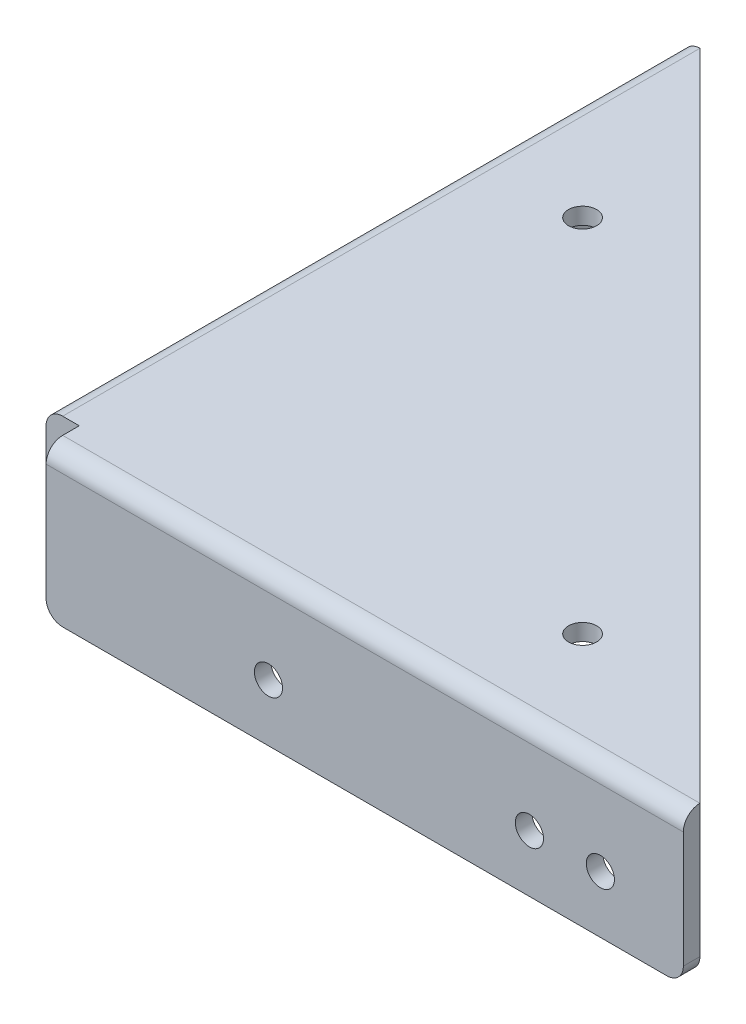
ISO-10303-21;
HEADER;
FILE_DESCRIPTION(('STEP AP214'),'2;1');
FILE_NAME('part.step','',(''),(''),'','','');
FILE_SCHEMA(('AUTOMOTIVE_DESIGN { 1 0 10303 214 1 1 1 1 }'));
ENDSEC;
DATA;
#1=APPLICATION_CONTEXT('core data for automotive mechanical design processes');
#2=APPLICATION_PROTOCOL_DEFINITION('international standard','automotive_design',2000,#1);
#3=PRODUCT_CONTEXT('',#1,'mechanical');
#4=PRODUCT('Part','Part','',(#3));
#5=PRODUCT_RELATED_PRODUCT_CATEGORY('part','',(#4));
#6=PRODUCT_DEFINITION_FORMATION('','',#4);
#7=PRODUCT_DEFINITION_CONTEXT('part definition',#1,'design');
#8=PRODUCT_DEFINITION('design','',#6,#7);
#9=PRODUCT_DEFINITION_SHAPE('','',#8);
#10=(LENGTH_UNIT() NAMED_UNIT(*) SI_UNIT(.MILLI.,.METRE.));
#11=(NAMED_UNIT(*) PLANE_ANGLE_UNIT() SI_UNIT($,.RADIAN.));
#12=(NAMED_UNIT(*) SI_UNIT($,.STERADIAN.) SOLID_ANGLE_UNIT());
#13=UNCERTAINTY_MEASURE_WITH_UNIT(LENGTH_MEASURE(1.E-05),#10,'distance_accuracy_value','');
#14=(GEOMETRIC_REPRESENTATION_CONTEXT(3) GLOBAL_UNCERTAINTY_ASSIGNED_CONTEXT((#13)) GLOBAL_UNIT_ASSIGNED_CONTEXT((#10,
#11,#12)) REPRESENTATION_CONTEXT('',''));
#15=CARTESIAN_POINT('',(0.,0.,0.));
#16=DIRECTION('',(0.,0.,1.));
#17=DIRECTION('',(1.,0.,0.));
#18=AXIS2_PLACEMENT_3D('',#15,#16,#17);
#19=CARTESIAN_POINT('',(0.,22.86,0.));
#20=DIRECTION('',(-1.,0.,0.));
#21=DIRECTION('',(0.,0.,1.));
#22=AXIS2_PLACEMENT_3D('',#19,#20,#21);
#23=PLANE('',#22);
#24=CARTESIAN_POINT('',(0.,8.73125,-79.0575));
#25=DIRECTION('',(-1.,0.,0.));
#26=DIRECTION('',(0.,0.,1.));
#27=AXIS2_PLACEMENT_3D('',#24,#25,#26);
#28=CIRCLE('',#27,2.15899999999999);
#29=CARTESIAN_POINT('',(0.,8.73125,-76.8985));
#30=VERTEX_POINT('',#29);
#31=EDGE_CURVE('E644',#30,#30,#28,.T.);
#32=ORIENTED_EDGE('',*,*,#31,.F.);
#33=EDGE_LOOP('',(#32));
#34=FACE_BOUND('',#33,.T.);
#35=CARTESIAN_POINT('',(0.,8.73125,-39.116));
#36=DIRECTION('',(-1.,0.,0.));
#37=DIRECTION('',(0.,0.,1.));
#38=AXIS2_PLACEMENT_3D('',#35,#36,#37);
#39=CIRCLE('',#38,2.15264999999999);
#40=CARTESIAN_POINT('',(0.,8.73125,-36.96335));
#41=VERTEX_POINT('',#40);
#42=EDGE_CURVE('E255',#41,#41,#39,.T.);
#43=ORIENTED_EDGE('',*,*,#42,.F.);
#44=EDGE_LOOP('',(#43));
#45=FACE_BOUND('',#44,.T.);
#46=CARTESIAN_POINT('',(0.,8.73125,-89.916));
#47=DIRECTION('',(-1.,0.,0.));
#48=DIRECTION('',(0.,0.,1.));
#49=AXIS2_PLACEMENT_3D('',#46,#47,#48);
#50=CIRCLE('',#49,2.15264999999999);
#51=CARTESIAN_POINT('',(0.,8.73125,-87.76335));
#52=VERTEX_POINT('',#51);
#53=EDGE_CURVE('E177',#52,#52,#50,.T.);
#54=ORIENTED_EDGE('',*,*,#53,.F.);
#55=EDGE_LOOP('',(#54));
#56=FACE_BOUND('',#55,.T.);
#57=DIRECTION('',(0.,-1.,0.));
#58=VECTOR('',#57,1.);
#59=CARTESIAN_POINT('',(0.,22.86,-102.616));
#60=LINE('',#59,#58);
#61=CARTESIAN_POINT('',(0.,20.32,-102.616));
#62=VERTEX_POINT('',#61);
#63=CARTESIAN_POINT('',(0.,2.54,-102.616));
#64=VERTEX_POINT('',#63);
#65=EDGE_CURVE('E211',#62,#64,#60,.T.);
#66=ORIENTED_EDGE('',*,*,#65,.T.);
#67=CARTESIAN_POINT('',(0.,2.54,-100.076));
#68=DIRECTION('',(-1.,0.,0.));
#69=DIRECTION('',(0.,0.,1.));
#70=AXIS2_PLACEMENT_3D('',#67,#68,#69);
#71=CIRCLE('',#70,2.54);
#72=CARTESIAN_POINT('',(0.,0.,-100.076));
#73=VERTEX_POINT('',#72);
#74=EDGE_CURVE('E276',#64,#73,#71,.T.);
#75=ORIENTED_EDGE('',*,*,#74,.T.);
#76=DIRECTION('',(0.,0.,-1.));
#77=VECTOR('',#76,1.);
#78=CARTESIAN_POINT('',(0.,0.,0.));
#79=LINE('',#78,#77);
#80=CARTESIAN_POINT('',(0.,0.,-7.61999999999999));
#81=VERTEX_POINT('',#80);
#82=EDGE_CURVE('E203',#81,#73,#79,.T.);
#83=ORIENTED_EDGE('',*,*,#82,.F.);
#84=CARTESIAN_POINT('',(0.,2.54,-7.61999999999999));
#85=DIRECTION('',(-1.,0.,0.));
#86=DIRECTION('',(0.,0.,1.));
#87=AXIS2_PLACEMENT_3D('',#84,#85,#86);
#88=CIRCLE('',#87,2.54);
#89=CARTESIAN_POINT('',(0.,2.54,-5.07999999999999));
#90=VERTEX_POINT('',#89);
#91=EDGE_CURVE('E274',#81,#90,#88,.T.);
#92=ORIENTED_EDGE('',*,*,#91,.T.);
#93=DIRECTION('',(0.,1.,0.));
#94=VECTOR('',#93,1.);
#95=CARTESIAN_POINT('',(0.,22.86,-5.07999999999999));
#96=LINE('',#95,#94);
#97=CARTESIAN_POINT('',(0.,20.32,-5.07999999999999));
#98=VERTEX_POINT('',#97);
#99=EDGE_CURVE('E187',#90,#98,#96,.T.);
#100=ORIENTED_EDGE('',*,*,#99,.T.);
#101=DIRECTION('',(0.,0.,-1.));
#102=VECTOR('',#101,1.);
#103=CARTESIAN_POINT('',(0.,20.32,0.));
#104=LINE('',#103,#102);
#105=EDGE_CURVE('E220',#98,#62,#104,.T.);
#106=ORIENTED_EDGE('',*,*,#105,.T.);
#107=EDGE_LOOP('',(#66,#75,#83,#92,#100,#106));
#108=FACE_BOUND('',#107,.T.);
#109=ADVANCED_FACE('F33',(#34,#45,#56,#108),#23,.T.);
#110=CARTESIAN_POINT('',(0.,22.86,0.));
#111=DIRECTION('',(0.,0.,1.));
#112=DIRECTION('',(1.,0.,0.));
#113=AXIS2_PLACEMENT_3D('',#110,#111,#112);
#114=PLANE('',#113);
#115=CARTESIAN_POINT('',(79.0575,8.73125,0.));
#116=DIRECTION('',(0.,0.,1.));
#117=DIRECTION('',(1.,0.,0.));
#118=AXIS2_PLACEMENT_3D('',#115,#116,#117);
#119=CIRCLE('',#118,2.15899999999999);
#120=CARTESIAN_POINT('',(81.2165,8.73125,0.));
#121=VERTEX_POINT('',#120);
#122=EDGE_CURVE('E650',#121,#121,#119,.T.);
#123=ORIENTED_EDGE('',*,*,#122,.F.);
#124=EDGE_LOOP('',(#123));
#125=FACE_BOUND('',#124,.T.);
#126=CARTESIAN_POINT('',(89.916,8.73125,0.));
#127=DIRECTION('',(0.,0.,1.));
#128=DIRECTION('',(1.,0.,0.));
#129=AXIS2_PLACEMENT_3D('',#126,#127,#128);
#130=CIRCLE('',#129,2.15264999999999);
#131=CARTESIAN_POINT('',(92.06865,8.73125,0.));
#132=VERTEX_POINT('',#131);
#133=EDGE_CURVE('E263',#132,#132,#130,.T.);
#134=ORIENTED_EDGE('',*,*,#133,.F.);
#135=EDGE_LOOP('',(#134));
#136=FACE_BOUND('',#135,.T.);
#137=CARTESIAN_POINT('',(39.116,8.73125,0.));
#138=DIRECTION('',(0.,0.,1.));
#139=DIRECTION('',(1.,0.,0.));
#140=AXIS2_PLACEMENT_3D('',#137,#138,#139);
#141=CIRCLE('',#140,2.15264999999999);
#142=CARTESIAN_POINT('',(41.26865,8.73125,0.));
#143=VERTEX_POINT('',#142);
#144=EDGE_CURVE('E262',#143,#143,#141,.T.);
#145=ORIENTED_EDGE('',*,*,#144,.F.);
#146=EDGE_LOOP('',(#145));
#147=FACE_BOUND('',#146,.T.);
#148=DIRECTION('',(-1.,0.,0.));
#149=VECTOR('',#148,1.);
#150=CARTESIAN_POINT('',(0.,0.,0.));
#151=LINE('',#150,#149);
#152=CARTESIAN_POINT('',(100.076,0.,0.));
#153=VERTEX_POINT('',#152);
#154=CARTESIAN_POINT('',(7.62000000000001,0.,0.));
#155=VERTEX_POINT('',#154);
#156=EDGE_CURVE('E206',#153,#155,#151,.T.);
#157=ORIENTED_EDGE('',*,*,#156,.F.);
#158=CARTESIAN_POINT('',(100.076,2.54,0.));
#159=DIRECTION('',(0.,0.,1.));
#160=DIRECTION('',(1.,0.,0.));
#161=AXIS2_PLACEMENT_3D('',#158,#159,#160);
#162=CIRCLE('',#161,2.54);
#163=CARTESIAN_POINT('',(102.616,2.54,0.));
#164=VERTEX_POINT('',#163);
#165=EDGE_CURVE('E285',#153,#164,#162,.T.);
#166=ORIENTED_EDGE('',*,*,#165,.T.);
#167=DIRECTION('',(0.,-1.,0.));
#168=VECTOR('',#167,1.);
#169=CARTESIAN_POINT('',(102.616,22.86,0.));
#170=LINE('',#169,#168);
#171=CARTESIAN_POINT('',(102.616,20.32,0.));
#172=VERTEX_POINT('',#171);
#173=EDGE_CURVE('E209',#172,#164,#170,.T.);
#174=ORIENTED_EDGE('',*,*,#173,.F.);
#175=DIRECTION('',(-1.,0.,0.));
#176=VECTOR('',#175,1.);
#177=CARTESIAN_POINT('',(0.,20.32,0.));
#178=LINE('',#177,#176);
#179=CARTESIAN_POINT('',(5.08000000000001,20.32,0.));
#180=VERTEX_POINT('',#179);
#181=EDGE_CURVE('E227',#172,#180,#178,.T.);
#182=ORIENTED_EDGE('',*,*,#181,.T.);
#183=DIRECTION('',(0.,-1.,0.));
#184=VECTOR('',#183,1.);
#185=CARTESIAN_POINT('',(5.08000000000001,22.86,0.));
#186=LINE('',#185,#184);
#187=CARTESIAN_POINT('',(5.08000000000001,2.54,0.));
#188=VERTEX_POINT('',#187);
#189=EDGE_CURVE('E162',#180,#188,#186,.T.);
#190=ORIENTED_EDGE('',*,*,#189,.T.);
#191=CARTESIAN_POINT('',(7.62000000000001,2.54,0.));
#192=DIRECTION('',(0.,0.,1.));
#193=DIRECTION('',(1.,0.,0.));
#194=AXIS2_PLACEMENT_3D('',#191,#192,#193);
#195=CIRCLE('',#194,2.54);
#196=EDGE_CURVE('E283',#188,#155,#195,.T.);
#197=ORIENTED_EDGE('',*,*,#196,.T.);
#198=EDGE_LOOP('',(#157,#166,#174,#182,#190,#197));
#199=FACE_BOUND('',#198,.T.);
#200=ADVANCED_FACE('F318',(#125,#136,#147,#199),#114,.T.);
#201=CARTESIAN_POINT('',(0.,22.86,0.));
#202=DIRECTION('',(0.,1.,0.));
#203=DIRECTION('',(0.,0.,1.));
#204=AXIS2_PLACEMENT_3D('',#201,#202,#203);
#205=PLANE('',#204);
#206=CARTESIAN_POINT('',(16.0103841816037,22.86,-71.185103576258));
#207=DIRECTION('',(0.,1.,0.));
#208=DIRECTION('',(0.,0.,1.));
#209=AXIS2_PLACEMENT_3D('',#206,#207,#208);
#210=CIRCLE('',#209,2.15264999999999);
#211=CARTESIAN_POINT('',(16.0103841816037,22.86,-69.032453576258));
#212=VERTEX_POINT('',#211);
#213=EDGE_CURVE('E611',#212,#212,#210,.T.);
#214=ORIENTED_EDGE('',*,*,#213,.F.);
#215=EDGE_LOOP('',(#214));
#216=FACE_BOUND('',#215,.T.);
#217=CARTESIAN_POINT('',(71.185103576258,22.86,-16.0103841816037));
#218=DIRECTION('',(0.,1.,0.));
#219=DIRECTION('',(0.,0.,1.));
#220=AXIS2_PLACEMENT_3D('',#217,#218,#219);
#221=CIRCLE('',#220,2.15264999999999);
#222=CARTESIAN_POINT('',(71.185103576258,22.86,-13.8577341816038));
#223=VERTEX_POINT('',#222);
#224=EDGE_CURVE('E607',#223,#223,#221,.T.);
#225=ORIENTED_EDGE('',*,*,#224,.F.);
#226=EDGE_LOOP('',(#225));
#227=FACE_BOUND('',#226,.T.);
#228=DIRECTION('',(0.,0.,-1.));
#229=VECTOR('',#228,1.);
#230=CARTESIAN_POINT('',(2.54,22.86,0.));
#231=LINE('',#230,#229);
#232=CARTESIAN_POINT('',(2.54,22.86,-102.616));
#233=VERTEX_POINT('',#232);
#234=CARTESIAN_POINT('',(2.54,22.86,-5.07999999999999));
#235=VERTEX_POINT('',#234);
#236=EDGE_CURVE('E176',#233,#235,#231,.F.);
#237=ORIENTED_EDGE('',*,*,#236,.T.);
#238=DIRECTION('',(1.,0.,0.));
#239=VECTOR('',#238,1.);
#240=CARTESIAN_POINT('',(-2.92435991916569,22.86,-5.07999999999999));
#241=LINE('',#240,#239);
#242=CARTESIAN_POINT('',(5.08000000000001,22.86,-5.07999999999999));
#243=VERTEX_POINT('',#242);
#244=EDGE_CURVE('E155',#235,#243,#241,.T.);
#245=ORIENTED_EDGE('',*,*,#244,.T.);
#246=DIRECTION('',(0.,0.,1.));
#247=VECTOR('',#246,1.);
#248=CARTESIAN_POINT('',(5.08000000000001,22.86,-5.07999999999999));
#249=LINE('',#248,#247);
#250=CARTESIAN_POINT('',(5.08000000000001,22.86,-2.54));
#251=VERTEX_POINT('',#250);
#252=EDGE_CURVE('E163',#243,#251,#249,.T.);
#253=ORIENTED_EDGE('',*,*,#252,.T.);
#254=DIRECTION('',(-1.,0.,0.));
#255=VECTOR('',#254,1.);
#256=CARTESIAN_POINT('',(0.,22.86,-2.54));
#257=LINE('',#256,#255);
#258=CARTESIAN_POINT('',(102.616,22.86,-2.54));
#259=VERTEX_POINT('',#258);
#260=EDGE_CURVE('E224',#251,#259,#257,.F.);
#261=ORIENTED_EDGE('',*,*,#260,.T.);
#262=DIRECTION('',(-0.707106781186547,0.,-0.707106781186547));
#263=VECTOR('',#262,1.);
#264=CARTESIAN_POINT('',(2.54,22.86,-102.616));
#265=LINE('',#264,#263);
#266=EDGE_CURVE('E195',#259,#233,#265,.T.);
#267=ORIENTED_EDGE('',*,*,#266,.T.);
#268=EDGE_LOOP('',(#237,#245,#253,#261,#267));
#269=FACE_BOUND('',#268,.T.);
#270=ADVANCED_FACE('F173',(#216,#227,#269),#205,.T.);
#271=CARTESIAN_POINT('',(0.,0.,0.));
#272=DIRECTION('',(0.,1.,0.));
#273=DIRECTION('',(0.,0.,1.));
#274=AXIS2_PLACEMENT_3D('',#271,#272,#273);
#275=PLANE('',#274);
#276=ORIENTED_EDGE('',*,*,#82,.T.);
#277=DIRECTION('',(1.,0.,0.));
#278=VECTOR('',#277,1.);
#279=CARTESIAN_POINT('',(2.54,0.,-100.076));
#280=LINE('',#279,#278);
#281=CARTESIAN_POINT('',(2.54,0.,-100.076));
#282=VERTEX_POINT('',#281);
#283=EDGE_CURVE('E265',#73,#282,#280,.T.);
#284=ORIENTED_EDGE('',*,*,#283,.T.);
#285=DIRECTION('',(0.,0.,1.));
#286=VECTOR('',#285,1.);
#287=CARTESIAN_POINT('',(2.54000000000001,0.,0.));
#288=LINE('',#287,#286);
#289=CARTESIAN_POINT('',(2.54000000000001,0.,-7.61999999999999));
#290=VERTEX_POINT('',#289);
#291=EDGE_CURVE('E200',#282,#290,#288,.T.);
#292=ORIENTED_EDGE('',*,*,#291,.T.);
#293=DIRECTION('',(1.,0.,0.));
#294=VECTOR('',#293,1.);
#295=CARTESIAN_POINT('',(0.,0.,-7.61999999999999));
#296=LINE('',#295,#294);
#297=EDGE_CURVE('E252',#290,#81,#296,.F.);
#298=ORIENTED_EDGE('',*,*,#297,.T.);
#299=EDGE_LOOP('',(#276,#284,#292,#298));
#300=FACE_BOUND('',#299,.T.);
#301=ADVANCED_FACE('F346',(#300),#275,.F.);
#302=DIRECTION('',(1.,0.,0.));
#303=VECTOR('',#302,1.);
#304=CARTESIAN_POINT('',(0.,0.,-2.53999999999999));
#305=LINE('',#304,#303);
#306=CARTESIAN_POINT('',(7.62000000000001,0.,-2.53999999999999));
#307=VERTEX_POINT('',#306);
#308=CARTESIAN_POINT('',(100.076,0.,-2.53999999999999));
#309=VERTEX_POINT('',#308);
#310=EDGE_CURVE('E194',#307,#309,#305,.T.);
#311=ORIENTED_EDGE('',*,*,#310,.T.);
#312=DIRECTION('',(0.,0.,1.));
#313=VECTOR('',#312,1.);
#314=CARTESIAN_POINT('',(100.076,0.,0.));
#315=LINE('',#314,#313);
#316=EDGE_CURVE('E280',#309,#153,#315,.T.);
#317=ORIENTED_EDGE('',*,*,#316,.T.);
#318=ORIENTED_EDGE('',*,*,#156,.T.);
#319=DIRECTION('',(0.,0.,1.));
#320=VECTOR('',#319,1.);
#321=CARTESIAN_POINT('',(7.62000000000001,0.,-2.53999999999999));
#322=LINE('',#321,#320);
#323=EDGE_CURVE('E278',#155,#307,#322,.F.);
#324=ORIENTED_EDGE('',*,*,#323,.T.);
#325=EDGE_LOOP('',(#311,#317,#318,#324));
#326=FACE_BOUND('',#325,.T.);
#327=ADVANCED_FACE('F320',(#326),#275,.F.);
#328=CARTESIAN_POINT('',(0.,20.32,-2.54));
#329=DIRECTION('',(-1.,0.,0.));
#330=DIRECTION('',(0.,0.,1.));
#331=AXIS2_PLACEMENT_3D('',#328,#329,#330);
#332=CYLINDRICAL_SURFACE('',#331,2.54);
#333=ORIENTED_EDGE('',*,*,#260,.F.);
#334=CARTESIAN_POINT('',(5.08000000000001,20.32,-2.54));
#335=DIRECTION('',(-1.,0.,0.));
#336=DIRECTION('',(0.,0.,1.));
#337=AXIS2_PLACEMENT_3D('',#334,#335,#336);
#338=CIRCLE('',#337,2.54);
#339=EDGE_CURVE('E168',#251,#180,#338,.F.);
#340=ORIENTED_EDGE('',*,*,#339,.T.);
#341=ORIENTED_EDGE('',*,*,#181,.F.);
#342=CARTESIAN_POINT('',(102.616,20.32,-2.54000000000001));
#343=DIRECTION('',(1.,0.,0.));
#344=DIRECTION('',(0.,0.,-1.));
#345=AXIS2_PLACEMENT_3D('',#342,#343,#344);
#346=CIRCLE('',#345,2.54);
#347=EDGE_CURVE('E230',#259,#172,#346,.T.);
#348=ORIENTED_EDGE('',*,*,#347,.F.);
#349=EDGE_LOOP('',(#333,#340,#341,#348));
#350=FACE_BOUND('',#349,.T.);
#351=ADVANCED_FACE('F332',(#350),#332,.T.);
#352=CARTESIAN_POINT('',(2.54,20.32,0.));
#353=DIRECTION('',(0.,0.,-1.));
#354=DIRECTION('',(-1.,0.,0.));
#355=AXIS2_PLACEMENT_3D('',#352,#353,#354);
#356=CYLINDRICAL_SURFACE('',#355,2.54);
#357=ORIENTED_EDGE('',*,*,#105,.F.);
#358=CARTESIAN_POINT('',(2.54,20.32,-5.07999999999999));
#359=DIRECTION('',(0.,0.,1.));
#360=DIRECTION('',(1.,0.,0.));
#361=AXIS2_PLACEMENT_3D('',#358,#359,#360);
#362=CIRCLE('',#361,2.54);
#363=EDGE_CURVE('E189',#98,#235,#362,.F.);
#364=ORIENTED_EDGE('',*,*,#363,.T.);
#365=ORIENTED_EDGE('',*,*,#236,.F.);
#366=CARTESIAN_POINT('',(2.54,20.32,-102.616));
#367=DIRECTION('',(0.,0.,-1.));
#368=DIRECTION('',(-1.,0.,0.));
#369=AXIS2_PLACEMENT_3D('',#366,#367,#368);
#370=CIRCLE('',#369,2.54);
#371=EDGE_CURVE('E222',#62,#233,#370,.T.);
#372=ORIENTED_EDGE('',*,*,#371,.F.);
#373=EDGE_LOOP('',(#357,#364,#365,#372));
#374=FACE_BOUND('',#373,.T.);
#375=ADVANCED_FACE('F338',(#374),#356,.T.);
#376=CARTESIAN_POINT('',(0.,22.86,-2.53999999999999));
#377=DIRECTION('',(0.,0.,-1.));
#378=DIRECTION('',(-1.,0.,0.));
#379=AXIS2_PLACEMENT_3D('',#376,#377,#378);
#380=PLANE('',#379);
#381=CARTESIAN_POINT('',(79.0575,8.73125,-2.53999999999999));
#382=DIRECTION('',(0.,0.,-1.));
#383=DIRECTION('',(-1.,0.,0.));
#384=AXIS2_PLACEMENT_3D('',#381,#382,#383);
#385=CIRCLE('',#384,2.15899999999999);
#386=CARTESIAN_POINT('',(76.8985,8.73125,-2.53999999999999));
#387=VERTEX_POINT('',#386);
#388=EDGE_CURVE('E37',#387,#387,#385,.T.);
#389=ORIENTED_EDGE('',*,*,#388,.F.);
#390=EDGE_LOOP('',(#389));
#391=FACE_BOUND('',#390,.T.);
#392=CARTESIAN_POINT('',(89.916,8.73125,-2.53999999999999));
#393=DIRECTION('',(0.,0.,-1.));
#394=DIRECTION('',(-1.,0.,0.));
#395=AXIS2_PLACEMENT_3D('',#392,#393,#394);
#396=CIRCLE('',#395,2.15264999999999);
#397=CARTESIAN_POINT('',(87.76335,8.73125,-2.53999999999999));
#398=VERTEX_POINT('',#397);
#399=EDGE_CURVE('E259',#398,#398,#396,.T.);
#400=ORIENTED_EDGE('',*,*,#399,.F.);
#401=EDGE_LOOP('',(#400));
#402=FACE_BOUND('',#401,.T.);
#403=CARTESIAN_POINT('',(39.116,8.73125,-2.53999999999999));
#404=DIRECTION('',(0.,0.,-1.));
#405=DIRECTION('',(-1.,0.,0.));
#406=AXIS2_PLACEMENT_3D('',#403,#404,#405);
#407=CIRCLE('',#406,2.15264999999999);
#408=CARTESIAN_POINT('',(36.96335,8.73125,-2.53999999999999));
#409=VERTEX_POINT('',#408);
#410=EDGE_CURVE('E623',#409,#409,#407,.T.);
#411=ORIENTED_EDGE('',*,*,#410,.F.);
#412=EDGE_LOOP('',(#411));
#413=FACE_BOUND('',#412,.T.);
#414=DIRECTION('',(0.,-1.,0.));
#415=VECTOR('',#414,1.);
#416=CARTESIAN_POINT('',(102.616,22.86,-2.54));
#417=LINE('',#416,#415);
#418=CARTESIAN_POINT('',(102.616,17.78,-2.54));
#419=VERTEX_POINT('',#418);
#420=CARTESIAN_POINT('',(102.616,2.54,-2.54));
#421=VERTEX_POINT('',#420);
#422=EDGE_CURVE('E217',#419,#421,#417,.T.);
#423=ORIENTED_EDGE('',*,*,#422,.T.);
#424=CARTESIAN_POINT('',(100.076,2.54,-2.53999999999999));
#425=DIRECTION('',(0.,0.,-1.));
#426=DIRECTION('',(-1.,0.,0.));
#427=AXIS2_PLACEMENT_3D('',#424,#425,#426);
#428=CIRCLE('',#427,2.54);
#429=EDGE_CURVE('E289',#421,#309,#428,.T.);
#430=ORIENTED_EDGE('',*,*,#429,.T.);
#431=ORIENTED_EDGE('',*,*,#310,.F.);
#432=CARTESIAN_POINT('',(7.62000000000001,2.54,-2.53999999999999));
#433=DIRECTION('',(0.,0.,-1.));
#434=DIRECTION('',(-1.,0.,0.));
#435=AXIS2_PLACEMENT_3D('',#432,#433,#434);
#436=CIRCLE('',#435,2.54);
#437=CARTESIAN_POINT('',(5.08000000000001,2.54,-2.53999999999999));
#438=VERTEX_POINT('',#437);
#439=EDGE_CURVE('E49',#307,#438,#436,.T.);
#440=ORIENTED_EDGE('',*,*,#439,.T.);
#441=DIRECTION('',(0.,-1.,0.));
#442=VECTOR('',#441,1.);
#443=CARTESIAN_POINT('',(5.08000000000001,20.32,-2.53999999999999));
#444=LINE('',#443,#442);
#445=CARTESIAN_POINT('',(5.08000000000001,17.78,-2.53999999999999));
#446=VERTEX_POINT('',#445);
#447=EDGE_CURVE('E241',#438,#446,#444,.F.);
#448=ORIENTED_EDGE('',*,*,#447,.T.);
#449=DIRECTION('',(1.,0.,0.));
#450=VECTOR('',#449,1.);
#451=CARTESIAN_POINT('',(0.,17.78,-2.53999999999999));
#452=LINE('',#451,#450);
#453=EDGE_CURVE('E238',#446,#419,#452,.T.);
#454=ORIENTED_EDGE('',*,*,#453,.T.);
#455=EDGE_LOOP('',(#423,#430,#431,#440,#448,#454));
#456=FACE_BOUND('',#455,.T.);
#457=ADVANCED_FACE('F383',(#391,#402,#413,#456),#380,.T.);
#458=CARTESIAN_POINT('',(2.54000000000001,22.86,0.));
#459=DIRECTION('',(1.,0.,0.));
#460=DIRECTION('',(0.,0.,-1.));
#461=AXIS2_PLACEMENT_3D('',#458,#459,#460);
#462=PLANE('',#461);
#463=CARTESIAN_POINT('',(2.54,8.73125,-79.0575));
#464=DIRECTION('',(1.,0.,0.));
#465=DIRECTION('',(0.,0.,-1.));
#466=AXIS2_PLACEMENT_3D('',#463,#464,#465);
#467=CIRCLE('',#466,2.15899999999999);
#468=CARTESIAN_POINT('',(2.54,8.73125,-81.2165));
#469=VERTEX_POINT('',#468);
#470=EDGE_CURVE('E647',#469,#469,#467,.T.);
#471=ORIENTED_EDGE('',*,*,#470,.F.);
#472=EDGE_LOOP('',(#471));
#473=FACE_BOUND('',#472,.T.);
#474=CARTESIAN_POINT('',(2.54000000000001,8.73125,-39.116));
#475=DIRECTION('',(1.,0.,0.));
#476=DIRECTION('',(0.,0.,-1.));
#477=AXIS2_PLACEMENT_3D('',#474,#475,#476);
#478=CIRCLE('',#477,2.15264999999999);
#479=CARTESIAN_POINT('',(2.54000000000001,8.73125,-41.26865));
#480=VERTEX_POINT('',#479);
#481=EDGE_CURVE('E258',#480,#480,#478,.T.);
#482=ORIENTED_EDGE('',*,*,#481,.F.);
#483=EDGE_LOOP('',(#482));
#484=FACE_BOUND('',#483,.T.);
#485=CARTESIAN_POINT('',(2.54,8.73125,-89.916));
#486=DIRECTION('',(1.,0.,0.));
#487=DIRECTION('',(0.,0.,-1.));
#488=AXIS2_PLACEMENT_3D('',#485,#486,#487);
#489=CIRCLE('',#488,2.15264999999999);
#490=CARTESIAN_POINT('',(2.54,8.73125,-92.06865));
#491=VERTEX_POINT('',#490);
#492=EDGE_CURVE('E180',#491,#491,#489,.T.);
#493=ORIENTED_EDGE('',*,*,#492,.F.);
#494=EDGE_LOOP('',(#493));
#495=FACE_BOUND('',#494,.T.);
#496=ORIENTED_EDGE('',*,*,#291,.F.);
#497=CARTESIAN_POINT('',(2.54,2.54,-100.076));
#498=DIRECTION('',(1.,0.,0.));
#499=DIRECTION('',(0.,0.,-1.));
#500=AXIS2_PLACEMENT_3D('',#497,#498,#499);
#501=CIRCLE('',#500,2.54);
#502=CARTESIAN_POINT('',(2.54,2.54,-102.616));
#503=VERTEX_POINT('',#502);
#504=EDGE_CURVE('E270',#282,#503,#501,.T.);
#505=ORIENTED_EDGE('',*,*,#504,.T.);
#506=DIRECTION('',(0.,-1.,0.));
#507=VECTOR('',#506,1.);
#508=CARTESIAN_POINT('',(2.54,22.86,-102.616));
#509=LINE('',#508,#507);
#510=CARTESIAN_POINT('',(2.54,17.78,-102.616));
#511=VERTEX_POINT('',#510);
#512=EDGE_CURVE('E214',#511,#503,#509,.T.);
#513=ORIENTED_EDGE('',*,*,#512,.F.);
#514=DIRECTION('',(0.,0.,1.));
#515=VECTOR('',#514,1.);
#516=CARTESIAN_POINT('',(2.54000000000001,17.78,0.));
#517=LINE('',#516,#515);
#518=CARTESIAN_POINT('',(2.54000000000001,17.78,-5.07999999999999));
#519=VERTEX_POINT('',#518);
#520=EDGE_CURVE('E232',#511,#519,#517,.T.);
#521=ORIENTED_EDGE('',*,*,#520,.T.);
#522=DIRECTION('',(0.,-1.,0.));
#523=VECTOR('',#522,1.);
#524=CARTESIAN_POINT('',(2.54000000000001,0.,-5.07999999999999));
#525=LINE('',#524,#523);
#526=CARTESIAN_POINT('',(2.54000000000001,2.54,-5.07999999999999));
#527=VERTEX_POINT('',#526);
#528=EDGE_CURVE('E235',#519,#527,#525,.T.);
#529=ORIENTED_EDGE('',*,*,#528,.T.);
#530=CARTESIAN_POINT('',(2.54000000000001,2.54,-7.61999999999999));
#531=DIRECTION('',(1.,0.,0.));
#532=DIRECTION('',(0.,0.,-1.));
#533=AXIS2_PLACEMENT_3D('',#530,#531,#532);
#534=CIRCLE('',#533,2.54);
#535=EDGE_CURVE('E268',#527,#290,#534,.T.);
#536=ORIENTED_EDGE('',*,*,#535,.T.);
#537=EDGE_LOOP('',(#496,#505,#513,#521,#529,#536));
#538=FACE_BOUND('',#537,.T.);
#539=ADVANCED_FACE('F297',(#473,#484,#495,#538),#462,.T.);
#540=CARTESIAN_POINT('',(102.616,22.86,0.));
#541=DIRECTION('',(1.,0.,0.));
#542=DIRECTION('',(0.,0.,-1.));
#543=AXIS2_PLACEMENT_3D('',#540,#541,#542);
#544=PLANE('',#543);
#545=ORIENTED_EDGE('',*,*,#173,.T.);
#546=DIRECTION('',(0.,0.,1.));
#547=VECTOR('',#546,1.);
#548=CARTESIAN_POINT('',(102.616,2.54,-2.54));
#549=LINE('',#548,#547);
#550=EDGE_CURVE('E57',#164,#421,#549,.F.);
#551=ORIENTED_EDGE('',*,*,#550,.T.);
#552=ORIENTED_EDGE('',*,*,#422,.F.);
#553=EDGE_CURVE('E218',#259,#419,#417,.T.);
#554=ORIENTED_EDGE('',*,*,#553,.F.);
#555=ORIENTED_EDGE('',*,*,#347,.T.);
#556=EDGE_LOOP('',(#545,#551,#552,#554,#555));
#557=FACE_BOUND('',#556,.T.);
#558=ADVANCED_FACE('F327',(#557),#544,.T.);
#559=CARTESIAN_POINT('',(0.,22.86,-102.616));
#560=DIRECTION('',(0.,0.,-1.));
#561=DIRECTION('',(-1.,0.,0.));
#562=AXIS2_PLACEMENT_3D('',#559,#560,#561);
#563=PLANE('',#562);
#564=ORIENTED_EDGE('',*,*,#512,.T.);
#565=DIRECTION('',(1.,0.,0.));
#566=VECTOR('',#565,1.);
#567=CARTESIAN_POINT('',(0.,2.54,-102.616));
#568=LINE('',#567,#566);
#569=EDGE_CURVE('E272',#503,#64,#568,.F.);
#570=ORIENTED_EDGE('',*,*,#569,.T.);
#571=ORIENTED_EDGE('',*,*,#65,.F.);
#572=ORIENTED_EDGE('',*,*,#371,.T.);
#573=EDGE_CURVE('E215',#233,#511,#509,.T.);
#574=ORIENTED_EDGE('',*,*,#573,.T.);
#575=EDGE_LOOP('',(#564,#570,#571,#572,#574));
#576=FACE_BOUND('',#575,.T.);
#577=ADVANCED_FACE('F351',(#576),#563,.T.);
#578=CARTESIAN_POINT('',(2.54,20.32,-102.616));
#579=DIRECTION('',(0.707106781186548,0.,-0.707106781186548));
#580=DIRECTION('',(-0.707106781186548,0.,-0.707106781186548));
#581=AXIS2_PLACEMENT_3D('',#578,#579,#580);
#582=PLANE('',#581);
#583=ORIENTED_EDGE('',*,*,#266,.F.);
#584=ORIENTED_EDGE('',*,*,#553,.T.);
#585=CARTESIAN_POINT('',(100.076,17.78,-5.07999999999999));
#586=DIRECTION('',(0.707106781186548,0.,-0.707106781186548));
#587=DIRECTION('',(0.707106781186548,0.,0.707106781186548));
#588=AXIS2_PLACEMENT_3D('',#585,#586,#587);
#589=ELLIPSE('',#588,3.59210244842766,2.54);
#590=CARTESIAN_POINT('',(100.076,20.32,-5.08));
#591=VERTEX_POINT('',#590);
#592=EDGE_CURVE('E247',#419,#591,#589,.F.);
#593=ORIENTED_EDGE('',*,*,#592,.T.);
#594=DIRECTION('',(-0.707106781186547,0.,-0.707106781186547));
#595=VECTOR('',#594,1.);
#596=CARTESIAN_POINT('',(2.54,20.32,-102.616));
#597=LINE('',#596,#595);
#598=CARTESIAN_POINT('',(5.08,20.32,-100.076));
#599=VERTEX_POINT('',#598);
#600=EDGE_CURVE('E191',#591,#599,#597,.T.);
#601=ORIENTED_EDGE('',*,*,#600,.T.);
#602=CARTESIAN_POINT('',(5.08,17.78,-100.076));
#603=DIRECTION('',(0.707106781186548,0.,-0.707106781186548));
#604=DIRECTION('',(0.707106781186548,0.,0.707106781186548));
#605=AXIS2_PLACEMENT_3D('',#602,#603,#604);
#606=ELLIPSE('',#605,3.59210244842766,2.54);
#607=EDGE_CURVE('E249',#599,#511,#606,.F.);
#608=ORIENTED_EDGE('',*,*,#607,.T.);
#609=ORIENTED_EDGE('',*,*,#573,.F.);
#610=EDGE_LOOP('',(#583,#584,#593,#601,#608,#609));
#611=FACE_BOUND('',#610,.T.);
#612=ADVANCED_FACE('F381',(#611),#582,.T.);
#613=CARTESIAN_POINT('',(0.,20.32,0.));
#614=DIRECTION('',(0.,1.,0.));
#615=DIRECTION('',(0.,0.,1.));
#616=AXIS2_PLACEMENT_3D('',#613,#614,#615);
#617=PLANE('',#616);
#618=CARTESIAN_POINT('',(16.0103841816037,20.32,-71.185103576258));
#619=DIRECTION('',(0.,-1.,0.));
#620=DIRECTION('',(0.,0.,-1.));
#621=AXIS2_PLACEMENT_3D('',#618,#619,#620);
#622=CIRCLE('',#621,2.15264999999999);
#623=CARTESIAN_POINT('',(16.0103841816037,20.32,-73.337753576258));
#624=VERTEX_POINT('',#623);
#625=EDGE_CURVE('E615',#624,#624,#622,.T.);
#626=ORIENTED_EDGE('',*,*,#625,.F.);
#627=EDGE_LOOP('',(#626));
#628=FACE_BOUND('',#627,.T.);
#629=CARTESIAN_POINT('',(71.185103576258,20.32,-16.0103841816037));
#630=DIRECTION('',(0.,-1.,0.));
#631=DIRECTION('',(0.,0.,-1.));
#632=AXIS2_PLACEMENT_3D('',#629,#630,#631);
#633=CIRCLE('',#632,2.15264999999999);
#634=CARTESIAN_POINT('',(71.185103576258,20.32,-18.1630341816037));
#635=VERTEX_POINT('',#634);
#636=EDGE_CURVE('E610',#635,#635,#633,.T.);
#637=ORIENTED_EDGE('',*,*,#636,.F.);
#638=EDGE_LOOP('',(#637));
#639=FACE_BOUND('',#638,.T.);
#640=ORIENTED_EDGE('',*,*,#600,.F.);
#641=DIRECTION('',(1.,0.,0.));
#642=VECTOR('',#641,1.);
#643=CARTESIAN_POINT('',(0.,20.32,-5.07999999999999));
#644=LINE('',#643,#642);
#645=CARTESIAN_POINT('',(5.08000000000001,20.32,-5.07999999999999));
#646=VERTEX_POINT('',#645);
#647=EDGE_CURVE('E245',#591,#646,#644,.F.);
#648=ORIENTED_EDGE('',*,*,#647,.T.);
#649=DIRECTION('',(0.,0.,1.));
#650=VECTOR('',#649,1.);
#651=CARTESIAN_POINT('',(5.08000000000001,20.32,0.));
#652=LINE('',#651,#650);
#653=EDGE_CURVE('E243',#646,#599,#652,.F.);
#654=ORIENTED_EDGE('',*,*,#653,.T.);
#655=EDGE_LOOP('',(#640,#648,#654));
#656=FACE_BOUND('',#655,.T.);
#657=ADVANCED_FACE('F396',(#628,#639,#656),#617,.F.);
#658=CARTESIAN_POINT('',(0.,17.78,-5.07999999999999));
#659=DIRECTION('',(1.,0.,0.));
#660=DIRECTION('',(0.,0.,-1.));
#661=AXIS2_PLACEMENT_3D('',#658,#659,#660);
#662=CYLINDRICAL_SURFACE('',#661,2.54);
#663=ORIENTED_EDGE('',*,*,#592,.F.);
#664=ORIENTED_EDGE('',*,*,#453,.F.);
#665=CARTESIAN_POINT('',(5.08000000000001,17.78,-5.07999999999999));
#666=DIRECTION('',(1.,0.,0.));
#667=DIRECTION('',(0.,0.,-1.));
#668=AXIS2_PLACEMENT_3D('',#665,#666,#667);
#669=CIRCLE('',#668,2.54);
#670=EDGE_CURVE('E197',#646,#446,#669,.T.);
#671=ORIENTED_EDGE('',*,*,#670,.F.);
#672=ORIENTED_EDGE('',*,*,#647,.F.);
#673=EDGE_LOOP('',(#663,#664,#671,#672));
#674=FACE_BOUND('',#673,.T.);
#675=ADVANCED_FACE('F312',(#674),#662,.F.);
#676=CARTESIAN_POINT('',(5.08000000000001,17.78,0.));
#677=DIRECTION('',(0.,0.,1.));
#678=DIRECTION('',(1.,0.,0.));
#679=AXIS2_PLACEMENT_3D('',#676,#677,#678);
#680=CYLINDRICAL_SURFACE('',#679,2.54);
#681=ORIENTED_EDGE('',*,*,#607,.F.);
#682=ORIENTED_EDGE('',*,*,#653,.F.);
#683=CARTESIAN_POINT('',(5.08000000000001,17.78,-5.07999999999999));
#684=DIRECTION('',(0.,0.,-1.));
#685=DIRECTION('',(-1.,0.,0.));
#686=AXIS2_PLACEMENT_3D('',#683,#684,#685);
#687=CIRCLE('',#686,2.54);
#688=EDGE_CURVE('E158',#519,#646,#687,.T.);
#689=ORIENTED_EDGE('',*,*,#688,.F.);
#690=ORIENTED_EDGE('',*,*,#520,.F.);
#691=EDGE_LOOP('',(#681,#682,#689,#690));
#692=FACE_BOUND('',#691,.T.);
#693=ADVANCED_FACE('F304',(#692),#680,.F.);
#694=CARTESIAN_POINT('',(-2.92435991916569,-11.684,-5.07999999999999));
#695=DIRECTION('',(0.,0.,1.));
#696=DIRECTION('',(1.,0.,0.));
#697=AXIS2_PLACEMENT_3D('',#694,#695,#696);
#698=PLANE('',#697);
#699=ORIENTED_EDGE('',*,*,#99,.F.);
#700=DIRECTION('',(1.,0.,0.));
#701=VECTOR('',#700,1.);
#702=CARTESIAN_POINT('',(2.54000000000001,2.54,-5.07999999999999));
#703=LINE('',#702,#701);
#704=EDGE_CURVE('E42',#90,#527,#703,.T.);
#705=ORIENTED_EDGE('',*,*,#704,.T.);
#706=ORIENTED_EDGE('',*,*,#528,.F.);
#707=ORIENTED_EDGE('',*,*,#688,.T.);
#708=DIRECTION('',(0.,1.,0.));
#709=VECTOR('',#708,1.);
#710=CARTESIAN_POINT('',(5.08000000000001,-11.684,-5.07999999999999));
#711=LINE('',#710,#709);
#712=EDGE_CURVE('E149',#646,#243,#711,.T.);
#713=ORIENTED_EDGE('',*,*,#712,.T.);
#714=ORIENTED_EDGE('',*,*,#244,.F.);
#715=ORIENTED_EDGE('',*,*,#363,.F.);
#716=EDGE_LOOP('',(#699,#705,#706,#707,#713,#714,#715));
#717=FACE_BOUND('',#716,.T.);
#718=ADVANCED_FACE('F152',(#717),#698,.T.);
#719=CARTESIAN_POINT('',(5.08000000000001,-11.684,-5.07999999999999));
#720=DIRECTION('',(-1.,0.,0.));
#721=DIRECTION('',(0.,0.,1.));
#722=AXIS2_PLACEMENT_3D('',#719,#720,#721);
#723=PLANE('',#722);
#724=ORIENTED_EDGE('',*,*,#447,.F.);
#725=DIRECTION('',(0.,0.,1.));
#726=VECTOR('',#725,1.);
#727=CARTESIAN_POINT('',(5.08000000000001,2.54,0.));
#728=LINE('',#727,#726);
#729=EDGE_CURVE('E11',#438,#188,#728,.T.);
#730=ORIENTED_EDGE('',*,*,#729,.T.);
#731=ORIENTED_EDGE('',*,*,#189,.F.);
#732=ORIENTED_EDGE('',*,*,#339,.F.);
#733=ORIENTED_EDGE('',*,*,#252,.F.);
#734=ORIENTED_EDGE('',*,*,#712,.F.);
#735=ORIENTED_EDGE('',*,*,#670,.T.);
#736=EDGE_LOOP('',(#724,#730,#731,#732,#733,#734,#735));
#737=FACE_BOUND('',#736,.T.);
#738=ADVANCED_FACE('F166',(#737),#723,.T.);
#739=CARTESIAN_POINT('',(2.54,8.73125,-89.916));
#740=DIRECTION('',(1.,0.,0.));
#741=DIRECTION('',(0.,0.,-1.));
#742=AXIS2_PLACEMENT_3D('',#739,#740,#741);
#743=CYLINDRICAL_SURFACE('',#742,2.15264999999999);
#744=ORIENTED_EDGE('',*,*,#53,.T.);
#745=EDGE_LOOP('',(#744));
#746=FACE_BOUND('',#745,.T.);
#747=ORIENTED_EDGE('',*,*,#492,.T.);
#748=EDGE_LOOP('',(#747));
#749=FACE_BOUND('',#748,.T.);
#750=ADVANCED_FACE('F440',(#746,#749),#743,.F.);
#751=CARTESIAN_POINT('',(2.54000000000001,8.73125,-39.116));
#752=DIRECTION('',(1.,0.,0.));
#753=DIRECTION('',(0.,0.,-1.));
#754=AXIS2_PLACEMENT_3D('',#751,#752,#753);
#755=CYLINDRICAL_SURFACE('',#754,2.15264999999999);
#756=ORIENTED_EDGE('',*,*,#42,.T.);
#757=EDGE_LOOP('',(#756));
#758=FACE_BOUND('',#757,.T.);
#759=ORIENTED_EDGE('',*,*,#481,.T.);
#760=EDGE_LOOP('',(#759));
#761=FACE_BOUND('',#760,.T.);
#762=ADVANCED_FACE('F559',(#758,#761),#755,.F.);
#763=CARTESIAN_POINT('',(39.116,8.73125,0.));
#764=DIRECTION('',(0.,0.,1.));
#765=DIRECTION('',(1.,0.,0.));
#766=AXIS2_PLACEMENT_3D('',#763,#764,#765);
#767=CYLINDRICAL_SURFACE('',#766,2.15264999999999);
#768=ORIENTED_EDGE('',*,*,#410,.T.);
#769=EDGE_LOOP('',(#768));
#770=FACE_BOUND('',#769,.T.);
#771=ORIENTED_EDGE('',*,*,#144,.T.);
#772=EDGE_LOOP('',(#771));
#773=FACE_BOUND('',#772,.T.);
#774=ADVANCED_FACE('F569',(#770,#773),#767,.F.);
#775=CARTESIAN_POINT('',(89.916,8.73125,0.));
#776=DIRECTION('',(0.,0.,1.));
#777=DIRECTION('',(1.,0.,0.));
#778=AXIS2_PLACEMENT_3D('',#775,#776,#777);
#779=CYLINDRICAL_SURFACE('',#778,2.15264999999999);
#780=ORIENTED_EDGE('',*,*,#399,.T.);
#781=EDGE_LOOP('',(#780));
#782=FACE_BOUND('',#781,.T.);
#783=ORIENTED_EDGE('',*,*,#133,.T.);
#784=EDGE_LOOP('',(#783));
#785=FACE_BOUND('',#784,.T.);
#786=ADVANCED_FACE('F578',(#782,#785),#779,.F.);
#787=CARTESIAN_POINT('',(71.185103576258,20.32,-16.0103841816037));
#788=DIRECTION('',(0.,-1.,0.));
#789=DIRECTION('',(0.,0.,-1.));
#790=AXIS2_PLACEMENT_3D('',#787,#788,#789);
#791=CYLINDRICAL_SURFACE('',#790,2.15264999999999);
#792=ORIENTED_EDGE('',*,*,#224,.T.);
#793=EDGE_LOOP('',(#792));
#794=FACE_BOUND('',#793,.T.);
#795=ORIENTED_EDGE('',*,*,#636,.T.);
#796=EDGE_LOOP('',(#795));
#797=FACE_BOUND('',#796,.T.);
#798=ADVANCED_FACE('F361',(#794,#797),#791,.F.);
#799=CARTESIAN_POINT('',(16.0103841816037,20.32,-71.185103576258));
#800=DIRECTION('',(0.,-1.,0.));
#801=DIRECTION('',(0.,0.,-1.));
#802=AXIS2_PLACEMENT_3D('',#799,#800,#801);
#803=CYLINDRICAL_SURFACE('',#802,2.15264999999999);
#804=ORIENTED_EDGE('',*,*,#213,.T.);
#805=EDGE_LOOP('',(#804));
#806=FACE_BOUND('',#805,.T.);
#807=ORIENTED_EDGE('',*,*,#625,.T.);
#808=EDGE_LOOP('',(#807));
#809=FACE_BOUND('',#808,.T.);
#810=ADVANCED_FACE('F354',(#806,#809),#803,.F.);
#811=CARTESIAN_POINT('',(0.,2.54,-100.076));
#812=DIRECTION('',(-1.,0.,0.));
#813=DIRECTION('',(0.,0.,1.));
#814=AXIS2_PLACEMENT_3D('',#811,#812,#813);
#815=CYLINDRICAL_SURFACE('',#814,2.54);
#816=ORIENTED_EDGE('',*,*,#74,.F.);
#817=ORIENTED_EDGE('',*,*,#569,.F.);
#818=ORIENTED_EDGE('',*,*,#504,.F.);
#819=ORIENTED_EDGE('',*,*,#283,.F.);
#820=EDGE_LOOP('',(#816,#817,#818,#819));
#821=FACE_BOUND('',#820,.T.);
#822=ADVANCED_FACE('F352',(#821),#815,.T.);
#823=CARTESIAN_POINT('',(100.076,2.54,0.));
#824=DIRECTION('',(0.,0.,-1.));
#825=DIRECTION('',(-1.,0.,0.));
#826=AXIS2_PLACEMENT_3D('',#823,#824,#825);
#827=CYLINDRICAL_SURFACE('',#826,2.54);
#828=ORIENTED_EDGE('',*,*,#429,.F.);
#829=ORIENTED_EDGE('',*,*,#550,.F.);
#830=ORIENTED_EDGE('',*,*,#165,.F.);
#831=ORIENTED_EDGE('',*,*,#316,.F.);
#832=EDGE_LOOP('',(#828,#829,#830,#831));
#833=FACE_BOUND('',#832,.T.);
#834=ADVANCED_FACE('F324',(#833),#827,.T.);
#835=CARTESIAN_POINT('',(-2.92435991916569,2.54,-7.61999999999999));
#836=DIRECTION('',(-1.,0.,0.));
#837=DIRECTION('',(0.,0.,1.));
#838=AXIS2_PLACEMENT_3D('',#835,#836,#837);
#839=CYLINDRICAL_SURFACE('',#838,2.54);
#840=ORIENTED_EDGE('',*,*,#91,.F.);
#841=ORIENTED_EDGE('',*,*,#297,.F.);
#842=ORIENTED_EDGE('',*,*,#535,.F.);
#843=ORIENTED_EDGE('',*,*,#704,.F.);
#844=EDGE_LOOP('',(#840,#841,#842,#843));
#845=FACE_BOUND('',#844,.T.);
#846=ADVANCED_FACE('F344',(#845),#839,.T.);
#847=CARTESIAN_POINT('',(7.62000000000001,2.54,-5.07999999999999));
#848=DIRECTION('',(0.,0.,-1.));
#849=DIRECTION('',(-1.,0.,0.));
#850=AXIS2_PLACEMENT_3D('',#847,#848,#849);
#851=CYLINDRICAL_SURFACE('',#850,2.54);
#852=ORIENTED_EDGE('',*,*,#439,.F.);
#853=ORIENTED_EDGE('',*,*,#323,.F.);
#854=ORIENTED_EDGE('',*,*,#196,.F.);
#855=ORIENTED_EDGE('',*,*,#729,.F.);
#856=EDGE_LOOP('',(#852,#853,#854,#855));
#857=FACE_BOUND('',#856,.T.);
#858=ADVANCED_FACE('F35',(#857),#851,.T.);
#859=CARTESIAN_POINT('',(-5.08,8.73125,-79.0575));
#860=DIRECTION('',(1.,0.,0.));
#861=DIRECTION('',(0.,0.,-1.));
#862=AXIS2_PLACEMENT_3D('',#859,#860,#861);
#863=CYLINDRICAL_SURFACE('',#862,2.15899999999999);
#864=ORIENTED_EDGE('',*,*,#31,.T.);
#865=EDGE_LOOP('',(#864));
#866=FACE_BOUND('',#865,.T.);
#867=ORIENTED_EDGE('',*,*,#470,.T.);
#868=EDGE_LOOP('',(#867));
#869=FACE_BOUND('',#868,.T.);
#870=ADVANCED_FACE('F465',(#866,#869),#863,.F.);
#871=CARTESIAN_POINT('',(79.0575,8.73125,-7.62));
#872=DIRECTION('',(0.,0.,1.));
#873=DIRECTION('',(1.,0.,0.));
#874=AXIS2_PLACEMENT_3D('',#871,#872,#873);
#875=CYLINDRICAL_SURFACE('',#874,2.15899999999999);
#876=ORIENTED_EDGE('',*,*,#388,.T.);
#877=EDGE_LOOP('',(#876));
#878=FACE_BOUND('',#877,.T.);
#879=ORIENTED_EDGE('',*,*,#122,.T.);
#880=EDGE_LOOP('',(#879));
#881=FACE_BOUND('',#880,.T.);
#882=ADVANCED_FACE('F474',(#878,#881),#875,.F.);
#883=CLOSED_SHELL('',(#109,#200,#270,#301,#327,#351,#375,#457,#539,#558,#577,#612,#657,#675,
#693,#718,#738,#750,#762,#774,#786,#798,#810,#822,#834,#846,#858,#870,#882));
#884=MANIFOLD_SOLID_BREP('B2',#883);
#885=ADVANCED_BREP_SHAPE_REPRESENTATION('',(#18,#884),#14);
#886=SHAPE_DEFINITION_REPRESENTATION(#9,#885);
ENDSEC;
END-ISO-10303-21;
